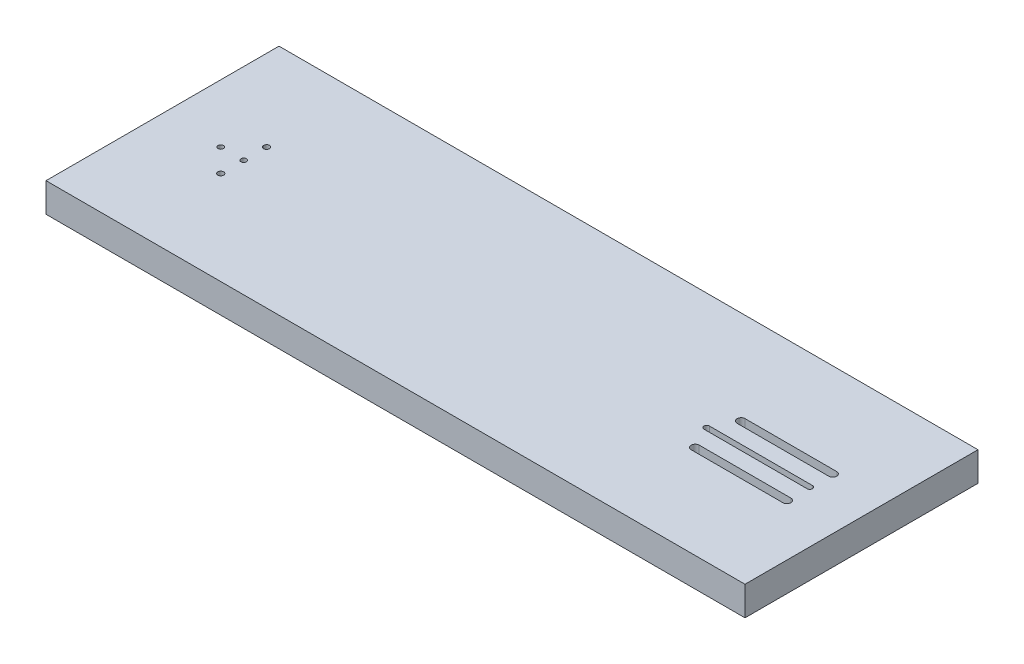
ISO-10303-21;
HEADER;
FILE_DESCRIPTION(('STEP AP214'),'2;1');
FILE_NAME('part.step','',(''),(''),'','','');
FILE_SCHEMA(('AUTOMOTIVE_DESIGN { 1 0 10303 214 1 1 1 1 }'));
ENDSEC;
DATA;
#1=APPLICATION_CONTEXT('core data for automotive mechanical design processes');
#2=APPLICATION_PROTOCOL_DEFINITION('international standard','automotive_design',2000,#1);
#3=PRODUCT_CONTEXT('',#1,'mechanical');
#4=PRODUCT('Part','Part','',(#3));
#5=PRODUCT_RELATED_PRODUCT_CATEGORY('part','',(#4));
#6=PRODUCT_DEFINITION_FORMATION('','',#4);
#7=PRODUCT_DEFINITION_CONTEXT('part definition',#1,'design');
#8=PRODUCT_DEFINITION('design','',#6,#7);
#9=PRODUCT_DEFINITION_SHAPE('','',#8);
#10=(LENGTH_UNIT() NAMED_UNIT(*) SI_UNIT(.MILLI.,.METRE.));
#11=(NAMED_UNIT(*) PLANE_ANGLE_UNIT() SI_UNIT($,.RADIAN.));
#12=(NAMED_UNIT(*) SI_UNIT($,.STERADIAN.) SOLID_ANGLE_UNIT());
#13=UNCERTAINTY_MEASURE_WITH_UNIT(LENGTH_MEASURE(1.E-05),#10,'distance_accuracy_value','');
#14=(GEOMETRIC_REPRESENTATION_CONTEXT(3) GLOBAL_UNCERTAINTY_ASSIGNED_CONTEXT((#13)) GLOBAL_UNIT_ASSIGNED_CONTEXT((#10,
#11,#12)) REPRESENTATION_CONTEXT('',''));
#15=CARTESIAN_POINT('',(0.,0.,0.));
#16=DIRECTION('',(0.,0.,1.));
#17=DIRECTION('',(1.,0.,0.));
#18=AXIS2_PLACEMENT_3D('',#15,#16,#17);
#19=CARTESIAN_POINT('',(484.541340044569,0.,-121.6));
#20=DIRECTION('',(0.,1.,0.));
#21=DIRECTION('',(0.,0.,1.));
#22=AXIS2_PLACEMENT_3D('',#19,#20,#21);
#23=CYLINDRICAL_SURFACE('',#22,3.49999999999999);
#24=CARTESIAN_POINT('',(484.541340044569,8.,-121.6));
#25=DIRECTION('',(0.,-1.,0.));
#26=DIRECTION('',(0.,0.,-1.));
#27=AXIS2_PLACEMENT_3D('',#24,#25,#26);
#28=CIRCLE('',#27,3.49999999999999);
#29=CARTESIAN_POINT('',(484.541340044569,8.,-125.1));
#30=VERTEX_POINT('',#29);
#31=CARTESIAN_POINT('',(484.541340044569,8.,-118.1));
#32=VERTEX_POINT('',#31);
#33=EDGE_CURVE('E57',#30,#32,#28,.F.);
#34=ORIENTED_EDGE('',*,*,#33,.F.);
#35=DIRECTION('',(0.,1.,0.));
#36=VECTOR('',#35,1.);
#37=CARTESIAN_POINT('',(484.541340044569,0.,-125.1));
#38=LINE('',#37,#36);
#39=CARTESIAN_POINT('',(484.541340044569,25.4,-125.1));
#40=VERTEX_POINT('',#39);
#41=EDGE_CURVE('E309',#30,#40,#38,.T.);
#42=ORIENTED_EDGE('',*,*,#41,.T.);
#43=CARTESIAN_POINT('',(484.541340044569,25.4,-121.6));
#44=DIRECTION('',(0.,1.,0.));
#45=DIRECTION('',(0.,0.,1.));
#46=AXIS2_PLACEMENT_3D('',#43,#44,#45);
#47=CIRCLE('',#46,3.49999999999999);
#48=CARTESIAN_POINT('',(484.541340044569,25.4,-118.1));
#49=VERTEX_POINT('',#48);
#50=EDGE_CURVE('E291',#40,#49,#47,.T.);
#51=ORIENTED_EDGE('',*,*,#50,.T.);
#52=DIRECTION('',(0.,1.,0.));
#53=VECTOR('',#52,1.);
#54=CARTESIAN_POINT('',(484.541340044569,0.,-118.1));
#55=LINE('',#54,#53);
#56=EDGE_CURVE('E308',#32,#49,#55,.T.);
#57=ORIENTED_EDGE('',*,*,#56,.F.);
#58=EDGE_LOOP('',(#34,#42,#51,#57));
#59=FACE_BOUND('',#58,.T.);
#60=ADVANCED_FACE('F35',(#59),#23,.F.);
#61=CARTESIAN_POINT('',(484.541340044569,0.,-125.1));
#62=DIRECTION('',(0.,0.,-1.));
#63=DIRECTION('',(-1.,0.,0.));
#64=AXIS2_PLACEMENT_3D('',#61,#62,#63);
#65=PLANE('',#64);
#66=DIRECTION('',(-1.,0.,0.));
#67=VECTOR('',#66,1.);
#68=CARTESIAN_POINT('',(484.541340044569,8.,-125.1));
#69=LINE('',#68,#67);
#70=CARTESIAN_POINT('',(564.541340044569,8.,-125.1));
#71=VERTEX_POINT('',#70);
#72=EDGE_CURVE('E235',#71,#30,#69,.T.);
#73=ORIENTED_EDGE('',*,*,#72,.F.);
#74=DIRECTION('',(0.,1.,0.));
#75=VECTOR('',#74,1.);
#76=CARTESIAN_POINT('',(564.541340044569,0.,-125.1));
#77=LINE('',#76,#75);
#78=CARTESIAN_POINT('',(564.541340044569,25.4,-125.1));
#79=VERTEX_POINT('',#78);
#80=EDGE_CURVE('E312',#71,#79,#77,.T.);
#81=ORIENTED_EDGE('',*,*,#80,.T.);
#82=DIRECTION('',(-1.,0.,0.));
#83=VECTOR('',#82,1.);
#84=CARTESIAN_POINT('',(484.541340044569,25.4,-125.1));
#85=LINE('',#84,#83);
#86=EDGE_CURVE('E305',#79,#40,#85,.T.);
#87=ORIENTED_EDGE('',*,*,#86,.T.);
#88=ORIENTED_EDGE('',*,*,#41,.F.);
#89=EDGE_LOOP('',(#73,#81,#87,#88));
#90=FACE_BOUND('',#89,.T.);
#91=ADVANCED_FACE('F440',(#90),#65,.F.);
#92=CARTESIAN_POINT('',(564.541340044569,0.,-121.6));
#93=DIRECTION('',(0.,1.,0.));
#94=DIRECTION('',(0.,0.,1.));
#95=AXIS2_PLACEMENT_3D('',#92,#93,#94);
#96=CYLINDRICAL_SURFACE('',#95,3.49999999999999);
#97=CARTESIAN_POINT('',(564.541340044569,8.,-121.6));
#98=DIRECTION('',(0.,-1.,0.));
#99=DIRECTION('',(0.,0.,-1.));
#100=AXIS2_PLACEMENT_3D('',#97,#98,#99);
#101=CIRCLE('',#100,3.49999999999999);
#102=CARTESIAN_POINT('',(564.541340044569,8.,-118.1));
#103=VERTEX_POINT('',#102);
#104=EDGE_CURVE('E230',#103,#71,#101,.F.);
#105=ORIENTED_EDGE('',*,*,#104,.F.);
#106=DIRECTION('',(0.,1.,0.));
#107=VECTOR('',#106,1.);
#108=CARTESIAN_POINT('',(564.541340044569,0.,-118.1));
#109=LINE('',#108,#107);
#110=CARTESIAN_POINT('',(564.541340044569,25.4,-118.1));
#111=VERTEX_POINT('',#110);
#112=EDGE_CURVE('E314',#103,#111,#109,.T.);
#113=ORIENTED_EDGE('',*,*,#112,.T.);
#114=CARTESIAN_POINT('',(564.541340044569,25.4,-121.6));
#115=DIRECTION('',(0.,1.,0.));
#116=DIRECTION('',(0.,0.,1.));
#117=AXIS2_PLACEMENT_3D('',#114,#115,#116);
#118=CIRCLE('',#117,3.49999999999999);
#119=EDGE_CURVE('E302',#111,#79,#118,.T.);
#120=ORIENTED_EDGE('',*,*,#119,.T.);
#121=ORIENTED_EDGE('',*,*,#80,.F.);
#122=EDGE_LOOP('',(#105,#113,#120,#121));
#123=FACE_BOUND('',#122,.T.);
#124=ADVANCED_FACE('F434',(#123),#96,.F.);
#125=CARTESIAN_POINT('',(484.541340044569,0.,-118.1));
#126=DIRECTION('',(0.,0.,1.));
#127=DIRECTION('',(1.,0.,0.));
#128=AXIS2_PLACEMENT_3D('',#125,#126,#127);
#129=PLANE('',#128);
#130=DIRECTION('',(1.,0.,0.));
#131=VECTOR('',#130,1.);
#132=CARTESIAN_POINT('',(484.541340044569,8.,-118.1));
#133=LINE('',#132,#131);
#134=EDGE_CURVE('E11',#32,#103,#133,.T.);
#135=ORIENTED_EDGE('',*,*,#134,.F.);
#136=ORIENTED_EDGE('',*,*,#56,.T.);
#137=DIRECTION('',(1.,0.,0.));
#138=VECTOR('',#137,1.);
#139=CARTESIAN_POINT('',(484.541340044569,25.4,-118.1));
#140=LINE('',#139,#138);
#141=EDGE_CURVE('E299',#49,#111,#140,.T.);
#142=ORIENTED_EDGE('',*,*,#141,.T.);
#143=ORIENTED_EDGE('',*,*,#112,.F.);
#144=EDGE_LOOP('',(#135,#136,#142,#143));
#145=FACE_BOUND('',#144,.T.);
#146=ADVANCED_FACE('F427',(#145),#129,.F.);
#147=CARTESIAN_POINT('',(484.541340044569,0.,-81.6));
#148=DIRECTION('',(0.,1.,0.));
#149=DIRECTION('',(0.,0.,1.));
#150=AXIS2_PLACEMENT_3D('',#147,#148,#149);
#151=CYLINDRICAL_SURFACE('',#150,3.5);
#152=CARTESIAN_POINT('',(484.541340044569,8.,-81.6));
#153=DIRECTION('',(0.,-1.,0.));
#154=DIRECTION('',(0.,0.,-1.));
#155=AXIS2_PLACEMENT_3D('',#152,#153,#154);
#156=CIRCLE('',#155,3.5);
#157=CARTESIAN_POINT('',(484.541340044569,8.,-85.1));
#158=VERTEX_POINT('',#157);
#159=CARTESIAN_POINT('',(484.541340044569,8.,-78.1));
#160=VERTEX_POINT('',#159);
#161=EDGE_CURVE('E274',#158,#160,#156,.F.);
#162=ORIENTED_EDGE('',*,*,#161,.F.);
#163=DIRECTION('',(0.,1.,0.));
#164=VECTOR('',#163,1.);
#165=CARTESIAN_POINT('',(484.541340044569,0.,-85.1));
#166=LINE('',#165,#164);
#167=CARTESIAN_POINT('',(484.541340044569,25.4,-85.1));
#168=VERTEX_POINT('',#167);
#169=EDGE_CURVE('E289',#158,#168,#166,.T.);
#170=ORIENTED_EDGE('',*,*,#169,.T.);
#171=CARTESIAN_POINT('',(484.541340044569,25.4,-81.6));
#172=DIRECTION('',(0.,1.,0.));
#173=DIRECTION('',(0.,0.,1.));
#174=AXIS2_PLACEMENT_3D('',#171,#172,#173);
#175=CIRCLE('',#174,3.5);
#176=CARTESIAN_POINT('',(484.541340044569,25.4,-78.1));
#177=VERTEX_POINT('',#176);
#178=EDGE_CURVE('E276',#168,#177,#175,.T.);
#179=ORIENTED_EDGE('',*,*,#178,.T.);
#180=DIRECTION('',(0.,1.,0.));
#181=VECTOR('',#180,1.);
#182=CARTESIAN_POINT('',(484.541340044569,0.,-78.1));
#183=LINE('',#182,#181);
#184=EDGE_CURVE('E288',#160,#177,#183,.T.);
#185=ORIENTED_EDGE('',*,*,#184,.F.);
#186=EDGE_LOOP('',(#162,#170,#179,#185));
#187=FACE_BOUND('',#186,.T.);
#188=ADVANCED_FACE('F425',(#187),#151,.F.);
#189=CARTESIAN_POINT('',(484.541340044569,0.,-85.1));
#190=DIRECTION('',(0.,0.,-1.));
#191=DIRECTION('',(-1.,0.,0.));
#192=AXIS2_PLACEMENT_3D('',#189,#190,#191);
#193=PLANE('',#192);
#194=DIRECTION('',(-1.,0.,0.));
#195=VECTOR('',#194,1.);
#196=CARTESIAN_POINT('',(484.541340044569,8.,-85.1));
#197=LINE('',#196,#195);
#198=CARTESIAN_POINT('',(564.541340044569,8.,-85.1));
#199=VERTEX_POINT('',#198);
#200=EDGE_CURVE('E272',#199,#158,#197,.T.);
#201=ORIENTED_EDGE('',*,*,#200,.F.);
#202=DIRECTION('',(0.,1.,0.));
#203=VECTOR('',#202,1.);
#204=CARTESIAN_POINT('',(564.541340044569,0.,-85.1));
#205=LINE('',#204,#203);
#206=CARTESIAN_POINT('',(564.541340044569,25.4,-85.1));
#207=VERTEX_POINT('',#206);
#208=EDGE_CURVE('E292',#199,#207,#205,.T.);
#209=ORIENTED_EDGE('',*,*,#208,.T.);
#210=DIRECTION('',(-1.,0.,0.));
#211=VECTOR('',#210,1.);
#212=CARTESIAN_POINT('',(484.541340044569,25.4,-85.1));
#213=LINE('',#212,#211);
#214=EDGE_CURVE('E285',#207,#168,#213,.T.);
#215=ORIENTED_EDGE('',*,*,#214,.T.);
#216=ORIENTED_EDGE('',*,*,#169,.F.);
#217=EDGE_LOOP('',(#201,#209,#215,#216));
#218=FACE_BOUND('',#217,.T.);
#219=ADVANCED_FACE('F423',(#218),#193,.F.);
#220=CARTESIAN_POINT('',(564.541340044569,0.,-81.6));
#221=DIRECTION('',(0.,1.,0.));
#222=DIRECTION('',(0.,0.,1.));
#223=AXIS2_PLACEMENT_3D('',#220,#221,#222);
#224=CYLINDRICAL_SURFACE('',#223,3.5);
#225=CARTESIAN_POINT('',(564.541340044569,8.,-81.6));
#226=DIRECTION('',(0.,-1.,0.));
#227=DIRECTION('',(0.,0.,-1.));
#228=AXIS2_PLACEMENT_3D('',#225,#226,#227);
#229=CIRCLE('',#228,3.5);
#230=CARTESIAN_POINT('',(564.541340044569,8.,-78.1));
#231=VERTEX_POINT('',#230);
#232=EDGE_CURVE('E264',#231,#199,#229,.F.);
#233=ORIENTED_EDGE('',*,*,#232,.F.);
#234=DIRECTION('',(0.,1.,0.));
#235=VECTOR('',#234,1.);
#236=CARTESIAN_POINT('',(564.541340044569,0.,-78.1));
#237=LINE('',#236,#235);
#238=CARTESIAN_POINT('',(564.541340044569,25.4,-78.1));
#239=VERTEX_POINT('',#238);
#240=EDGE_CURVE('E294',#231,#239,#237,.T.);
#241=ORIENTED_EDGE('',*,*,#240,.T.);
#242=CARTESIAN_POINT('',(564.541340044569,25.4,-81.6));
#243=DIRECTION('',(0.,1.,0.));
#244=DIRECTION('',(0.,0.,1.));
#245=AXIS2_PLACEMENT_3D('',#242,#243,#244);
#246=CIRCLE('',#245,3.5);
#247=EDGE_CURVE('E282',#239,#207,#246,.T.);
#248=ORIENTED_EDGE('',*,*,#247,.T.);
#249=ORIENTED_EDGE('',*,*,#208,.F.);
#250=EDGE_LOOP('',(#233,#241,#248,#249));
#251=FACE_BOUND('',#250,.T.);
#252=ADVANCED_FACE('F412',(#251),#224,.F.);
#253=CARTESIAN_POINT('',(484.541340044569,0.,-78.1));
#254=DIRECTION('',(0.,0.,1.));
#255=DIRECTION('',(1.,0.,0.));
#256=AXIS2_PLACEMENT_3D('',#253,#254,#255);
#257=PLANE('',#256);
#258=DIRECTION('',(1.,0.,0.));
#259=VECTOR('',#258,1.);
#260=CARTESIAN_POINT('',(484.541340044569,8.,-78.1));
#261=LINE('',#260,#259);
#262=EDGE_CURVE('E43',#160,#231,#261,.T.);
#263=ORIENTED_EDGE('',*,*,#262,.F.);
#264=ORIENTED_EDGE('',*,*,#184,.T.);
#265=DIRECTION('',(1.,0.,0.));
#266=VECTOR('',#265,1.);
#267=CARTESIAN_POINT('',(484.541340044569,25.4,-78.1));
#268=LINE('',#267,#266);
#269=EDGE_CURVE('E279',#177,#239,#268,.T.);
#270=ORIENTED_EDGE('',*,*,#269,.T.);
#271=ORIENTED_EDGE('',*,*,#240,.F.);
#272=EDGE_LOOP('',(#263,#264,#270,#271));
#273=FACE_BOUND('',#272,.T.);
#274=ADVANCED_FACE('F413',(#273),#257,.F.);
#275=CARTESIAN_POINT('',(0.,25.4,0.));
#276=DIRECTION('',(1.,0.,0.));
#277=DIRECTION('',(0.,0.,-1.));
#278=AXIS2_PLACEMENT_3D('',#275,#276,#277);
#279=PLANE('',#278);
#280=DIRECTION('',(0.,0.,1.));
#281=VECTOR('',#280,1.);
#282=CARTESIAN_POINT('',(0.,0.,0.));
#283=LINE('',#282,#281);
#284=CARTESIAN_POINT('',(0.,0.,-203.2));
#285=VERTEX_POINT('',#284);
#286=CARTESIAN_POINT('',(0.,0.,0.));
#287=VERTEX_POINT('',#286);
#288=EDGE_CURVE('E370',#285,#287,#283,.T.);
#289=ORIENTED_EDGE('',*,*,#288,.T.);
#290=DIRECTION('',(0.,-1.,0.));
#291=VECTOR('',#290,1.);
#292=CARTESIAN_POINT('',(0.,25.4,0.));
#293=LINE('',#292,#291);
#294=CARTESIAN_POINT('',(0.,25.4,0.));
#295=VERTEX_POINT('',#294);
#296=EDGE_CURVE('E399',#295,#287,#293,.T.);
#297=ORIENTED_EDGE('',*,*,#296,.F.);
#298=DIRECTION('',(0.,0.,1.));
#299=VECTOR('',#298,1.);
#300=CARTESIAN_POINT('',(0.,25.4,0.));
#301=LINE('',#300,#299);
#302=CARTESIAN_POINT('',(0.,25.4,-203.2));
#303=VERTEX_POINT('',#302);
#304=EDGE_CURVE('E373',#303,#295,#301,.T.);
#305=ORIENTED_EDGE('',*,*,#304,.F.);
#306=DIRECTION('',(0.,-1.,0.));
#307=VECTOR('',#306,1.);
#308=CARTESIAN_POINT('',(0.,25.4,-203.2));
#309=LINE('',#308,#307);
#310=EDGE_CURVE('E383',#303,#285,#309,.T.);
#311=ORIENTED_EDGE('',*,*,#310,.T.);
#312=EDGE_LOOP('',(#289,#297,#305,#311));
#313=FACE_BOUND('',#312,.T.);
#314=ADVANCED_FACE('F37',(#313),#279,.F.);
#315=CARTESIAN_POINT('',(0.,25.4,0.));
#316=DIRECTION('',(0.,0.,-1.));
#317=DIRECTION('',(-1.,0.,0.));
#318=AXIS2_PLACEMENT_3D('',#315,#316,#317);
#319=PLANE('',#318);
#320=DIRECTION('',(1.,0.,0.));
#321=VECTOR('',#320,1.);
#322=CARTESIAN_POINT('',(0.,0.,0.));
#323=LINE('',#322,#321);
#324=CARTESIAN_POINT('',(609.6,0.,0.));
#325=VERTEX_POINT('',#324);
#326=EDGE_CURVE('E386',#287,#325,#323,.T.);
#327=ORIENTED_EDGE('',*,*,#326,.T.);
#328=DIRECTION('',(0.,-1.,0.));
#329=VECTOR('',#328,1.);
#330=CARTESIAN_POINT('',(609.6,25.4,0.));
#331=LINE('',#330,#329);
#332=CARTESIAN_POINT('',(609.6,25.4,0.));
#333=VERTEX_POINT('',#332);
#334=EDGE_CURVE('E396',#333,#325,#331,.T.);
#335=ORIENTED_EDGE('',*,*,#334,.F.);
#336=DIRECTION('',(1.,0.,0.));
#337=VECTOR('',#336,1.);
#338=CARTESIAN_POINT('',(0.,25.4,0.));
#339=LINE('',#338,#337);
#340=EDGE_CURVE('E376',#295,#333,#339,.T.);
#341=ORIENTED_EDGE('',*,*,#340,.F.);
#342=ORIENTED_EDGE('',*,*,#296,.T.);
#343=EDGE_LOOP('',(#327,#335,#341,#342));
#344=FACE_BOUND('',#343,.T.);
#345=ADVANCED_FACE('F493',(#344),#319,.F.);
#346=CARTESIAN_POINT('',(609.6,25.4,0.));
#347=DIRECTION('',(-1.,0.,0.));
#348=DIRECTION('',(0.,0.,1.));
#349=AXIS2_PLACEMENT_3D('',#346,#347,#348);
#350=PLANE('',#349);
#351=DIRECTION('',(0.,0.,-1.));
#352=VECTOR('',#351,1.);
#353=CARTESIAN_POINT('',(609.6,0.,0.));
#354=LINE('',#353,#352);
#355=CARTESIAN_POINT('',(609.6,0.,-203.2));
#356=VERTEX_POINT('',#355);
#357=EDGE_CURVE('E388',#325,#356,#354,.T.);
#358=ORIENTED_EDGE('',*,*,#357,.T.);
#359=DIRECTION('',(0.,-1.,0.));
#360=VECTOR('',#359,1.);
#361=CARTESIAN_POINT('',(609.6,25.4,-203.2));
#362=LINE('',#361,#360);
#363=CARTESIAN_POINT('',(609.6,25.4,-203.2));
#364=VERTEX_POINT('',#363);
#365=EDGE_CURVE('E393',#364,#356,#362,.T.);
#366=ORIENTED_EDGE('',*,*,#365,.F.);
#367=DIRECTION('',(0.,0.,-1.));
#368=VECTOR('',#367,1.);
#369=CARTESIAN_POINT('',(609.6,25.4,0.));
#370=LINE('',#369,#368);
#371=EDGE_CURVE('E379',#333,#364,#370,.T.);
#372=ORIENTED_EDGE('',*,*,#371,.F.);
#373=ORIENTED_EDGE('',*,*,#334,.T.);
#374=EDGE_LOOP('',(#358,#366,#372,#373));
#375=FACE_BOUND('',#374,.T.);
#376=ADVANCED_FACE('F490',(#375),#350,.F.);
#377=CARTESIAN_POINT('',(0.,25.4,-203.2));
#378=DIRECTION('',(0.,0.,1.));
#379=DIRECTION('',(1.,0.,0.));
#380=AXIS2_PLACEMENT_3D('',#377,#378,#379);
#381=PLANE('',#380);
#382=DIRECTION('',(-1.,0.,0.));
#383=VECTOR('',#382,1.);
#384=CARTESIAN_POINT('',(0.,0.,-203.2));
#385=LINE('',#384,#383);
#386=EDGE_CURVE('E377',#356,#285,#385,.T.);
#387=ORIENTED_EDGE('',*,*,#386,.T.);
#388=ORIENTED_EDGE('',*,*,#310,.F.);
#389=DIRECTION('',(-1.,0.,0.));
#390=VECTOR('',#389,1.);
#391=CARTESIAN_POINT('',(0.,25.4,-203.2));
#392=LINE('',#391,#390);
#393=EDGE_CURVE('E381',#364,#303,#392,.T.);
#394=ORIENTED_EDGE('',*,*,#393,.F.);
#395=ORIENTED_EDGE('',*,*,#365,.T.);
#396=EDGE_LOOP('',(#387,#388,#394,#395));
#397=FACE_BOUND('',#396,.T.);
#398=ADVANCED_FACE('F484',(#397),#381,.F.);
#399=CARTESIAN_POINT('',(0.,25.4,0.));
#400=DIRECTION('',(0.,-1.,0.));
#401=DIRECTION('',(0.,0.,-1.));
#402=AXIS2_PLACEMENT_3D('',#399,#400,#401);
#403=PLANE('',#402);
#404=ORIENTED_EDGE('',*,*,#269,.F.);
#405=ORIENTED_EDGE('',*,*,#178,.F.);
#406=ORIENTED_EDGE('',*,*,#214,.F.);
#407=ORIENTED_EDGE('',*,*,#247,.F.);
#408=EDGE_LOOP('',(#404,#405,#406,#407));
#409=FACE_BOUND('',#408,.T.);
#410=ORIENTED_EDGE('',*,*,#141,.F.);
#411=ORIENTED_EDGE('',*,*,#50,.F.);
#412=ORIENTED_EDGE('',*,*,#86,.F.);
#413=ORIENTED_EDGE('',*,*,#119,.F.);
#414=EDGE_LOOP('',(#410,#411,#412,#413));
#415=FACE_BOUND('',#414,.T.);
#416=DIRECTION('',(1.,0.,0.));
#417=VECTOR('',#416,1.);
#418=CARTESIAN_POINT('',(474.530890234494,25.4,-99.2185));
#419=LINE('',#418,#417);
#420=CARTESIAN_POINT('',(474.530890234494,25.4,-99.2185));
#421=VERTEX_POINT('',#420);
#422=CARTESIAN_POINT('',(564.530890234494,25.4,-99.2185));
#423=VERTEX_POINT('',#422);
#424=EDGE_CURVE('E332',#421,#423,#419,.T.);
#425=ORIENTED_EDGE('',*,*,#424,.F.);
#426=CARTESIAN_POINT('',(474.530890234494,25.4,-101.6));
#427=DIRECTION('',(0.,1.,0.));
#428=DIRECTION('',(0.,0.,1.));
#429=AXIS2_PLACEMENT_3D('',#426,#427,#428);
#430=CIRCLE('',#429,2.38149999999999);
#431=CARTESIAN_POINT('',(474.530890234494,25.4,-103.9815));
#432=VERTEX_POINT('',#431);
#433=EDGE_CURVE('E311',#432,#421,#430,.T.);
#434=ORIENTED_EDGE('',*,*,#433,.F.);
#435=DIRECTION('',(-1.,0.,0.));
#436=VECTOR('',#435,1.);
#437=CARTESIAN_POINT('',(474.530890234494,25.4,-103.9815));
#438=LINE('',#437,#436);
#439=CARTESIAN_POINT('',(564.530890234494,25.4,-103.9815));
#440=VERTEX_POINT('',#439);
#441=EDGE_CURVE('E321',#440,#432,#438,.T.);
#442=ORIENTED_EDGE('',*,*,#441,.F.);
#443=CARTESIAN_POINT('',(564.530890234494,25.4,-101.6));
#444=DIRECTION('',(0.,1.,0.));
#445=DIRECTION('',(0.,0.,1.));
#446=AXIS2_PLACEMENT_3D('',#443,#444,#445);
#447=CIRCLE('',#446,2.38149999999999);
#448=EDGE_CURVE('E335',#423,#440,#447,.T.);
#449=ORIENTED_EDGE('',*,*,#448,.F.);
#450=EDGE_LOOP('',(#425,#434,#442,#449));
#451=FACE_BOUND('',#450,.T.);
#452=CARTESIAN_POINT('',(70.8,25.4,-81.6));
#453=DIRECTION('',(0.,1.,0.));
#454=DIRECTION('',(0.,0.,1.));
#455=AXIS2_PLACEMENT_3D('',#452,#453,#454);
#456=CIRCLE('',#455,2.5525);
#457=CARTESIAN_POINT('',(70.8,25.4,-79.0475));
#458=VERTEX_POINT('',#457);
#459=EDGE_CURVE('E342',#458,#458,#456,.T.);
#460=ORIENTED_EDGE('',*,*,#459,.F.);
#461=EDGE_LOOP('',(#460));
#462=FACE_BOUND('',#461,.T.);
#463=CARTESIAN_POINT('',(70.8,25.4,-121.6));
#464=DIRECTION('',(0.,1.,0.));
#465=DIRECTION('',(0.,0.,1.));
#466=AXIS2_PLACEMENT_3D('',#463,#464,#465);
#467=CIRCLE('',#466,2.5525);
#468=CARTESIAN_POINT('',(70.8,25.4,-119.0475));
#469=VERTEX_POINT('',#468);
#470=EDGE_CURVE('E352',#469,#469,#467,.T.);
#471=ORIENTED_EDGE('',*,*,#470,.F.);
#472=EDGE_LOOP('',(#471));
#473=FACE_BOUND('',#472,.T.);
#474=CARTESIAN_POINT('',(50.8,25.4,-101.6));
#475=DIRECTION('',(0.,1.,0.));
#476=DIRECTION('',(0.,0.,1.));
#477=AXIS2_PLACEMENT_3D('',#474,#475,#476);
#478=CIRCLE('',#477,2.3815);
#479=CARTESIAN_POINT('',(50.8,25.4,-99.2185));
#480=VERTEX_POINT('',#479);
#481=EDGE_CURVE('E358',#480,#480,#478,.T.);
#482=ORIENTED_EDGE('',*,*,#481,.F.);
#483=EDGE_LOOP('',(#482));
#484=FACE_BOUND('',#483,.T.);
#485=CARTESIAN_POINT('',(70.8,25.4,-101.6));
#486=DIRECTION('',(0.,1.,0.));
#487=DIRECTION('',(0.,0.,1.));
#488=AXIS2_PLACEMENT_3D('',#485,#486,#487);
#489=CIRCLE('',#488,2.3815);
#490=CARTESIAN_POINT('',(70.8,25.4,-99.2185));
#491=VERTEX_POINT('',#490);
#492=EDGE_CURVE('E364',#491,#491,#489,.T.);
#493=ORIENTED_EDGE('',*,*,#492,.F.);
#494=EDGE_LOOP('',(#493));
#495=FACE_BOUND('',#494,.T.);
#496=ORIENTED_EDGE('',*,*,#304,.T.);
#497=ORIENTED_EDGE('',*,*,#340,.T.);
#498=ORIENTED_EDGE('',*,*,#371,.T.);
#499=ORIENTED_EDGE('',*,*,#393,.T.);
#500=EDGE_LOOP('',(#496,#497,#498,#499));
#501=FACE_BOUND('',#500,.T.);
#502=ADVANCED_FACE('F419',(#409,#415,#451,#462,#473,#484,#495,#501),#403,.F.);
#503=CARTESIAN_POINT('',(0.,0.,0.));
#504=DIRECTION('',(0.,-1.,0.));
#505=DIRECTION('',(0.,0.,-1.));
#506=AXIS2_PLACEMENT_3D('',#503,#504,#505);
#507=PLANE('',#506);
#508=CARTESIAN_POINT('',(484.541340044569,0.,-121.6));
#509=DIRECTION('',(0.,-1.,0.));
#510=DIRECTION('',(0.,0.,-1.));
#511=AXIS2_PLACEMENT_3D('',#508,#509,#510);
#512=CIRCLE('',#511,5.49999999999996);
#513=CARTESIAN_POINT('',(484.541340044569,0.,-116.1));
#514=VERTEX_POINT('',#513);
#515=CARTESIAN_POINT('',(484.541340044569,0.,-127.1));
#516=VERTEX_POINT('',#515);
#517=EDGE_CURVE('E50',#514,#516,#512,.T.);
#518=ORIENTED_EDGE('',*,*,#517,.F.);
#519=DIRECTION('',(-1.,0.,0.));
#520=VECTOR('',#519,1.);
#521=CARTESIAN_POINT('',(484.541340044569,0.,-116.1));
#522=LINE('',#521,#520);
#523=CARTESIAN_POINT('',(564.541340044569,0.,-116.1));
#524=VERTEX_POINT('',#523);
#525=EDGE_CURVE('E215',#524,#514,#522,.T.);
#526=ORIENTED_EDGE('',*,*,#525,.F.);
#527=CARTESIAN_POINT('',(564.541340044569,0.,-121.6));
#528=DIRECTION('',(0.,-1.,0.));
#529=DIRECTION('',(0.,0.,-1.));
#530=AXIS2_PLACEMENT_3D('',#527,#528,#529);
#531=CIRCLE('',#530,5.49999999999996);
#532=CARTESIAN_POINT('',(564.541340044569,0.,-127.1));
#533=VERTEX_POINT('',#532);
#534=EDGE_CURVE('E218',#533,#524,#531,.T.);
#535=ORIENTED_EDGE('',*,*,#534,.F.);
#536=DIRECTION('',(1.,0.,0.));
#537=VECTOR('',#536,1.);
#538=CARTESIAN_POINT('',(484.541340044569,0.,-127.1));
#539=LINE('',#538,#537);
#540=EDGE_CURVE('E224',#516,#533,#539,.T.);
#541=ORIENTED_EDGE('',*,*,#540,.F.);
#542=EDGE_LOOP('',(#518,#526,#535,#541));
#543=FACE_BOUND('',#542,.T.);
#544=CARTESIAN_POINT('',(484.541340044569,0.,-81.6));
#545=DIRECTION('',(0.,-1.,0.));
#546=DIRECTION('',(0.,0.,-1.));
#547=AXIS2_PLACEMENT_3D('',#544,#545,#546);
#548=CIRCLE('',#547,5.49999999999999);
#549=CARTESIAN_POINT('',(484.541340044569,0.,-76.1));
#550=VERTEX_POINT('',#549);
#551=CARTESIAN_POINT('',(484.541340044569,0.,-87.1));
#552=VERTEX_POINT('',#551);
#553=EDGE_CURVE('E238',#550,#552,#548,.T.);
#554=ORIENTED_EDGE('',*,*,#553,.F.);
#555=DIRECTION('',(-1.,0.,0.));
#556=VECTOR('',#555,1.);
#557=CARTESIAN_POINT('',(484.541340044569,0.,-76.1));
#558=LINE('',#557,#556);
#559=CARTESIAN_POINT('',(564.541340044569,0.,-76.1));
#560=VERTEX_POINT('',#559);
#561=EDGE_CURVE('E243',#560,#550,#558,.T.);
#562=ORIENTED_EDGE('',*,*,#561,.F.);
#563=CARTESIAN_POINT('',(564.541340044569,0.,-81.6));
#564=DIRECTION('',(0.,-1.,0.));
#565=DIRECTION('',(0.,0.,-1.));
#566=AXIS2_PLACEMENT_3D('',#563,#564,#565);
#567=CIRCLE('',#566,5.49999999999999);
#568=CARTESIAN_POINT('',(564.541340044569,0.,-87.1));
#569=VERTEX_POINT('',#568);
#570=EDGE_CURVE('E257',#569,#560,#567,.T.);
#571=ORIENTED_EDGE('',*,*,#570,.F.);
#572=DIRECTION('',(1.,0.,0.));
#573=VECTOR('',#572,1.);
#574=CARTESIAN_POINT('',(484.541340044569,0.,-87.1));
#575=LINE('',#574,#573);
#576=EDGE_CURVE('E254',#552,#569,#575,.T.);
#577=ORIENTED_EDGE('',*,*,#576,.F.);
#578=EDGE_LOOP('',(#554,#562,#571,#577));
#579=FACE_BOUND('',#578,.T.);
#580=CARTESIAN_POINT('',(474.530890234494,0.,-101.6));
#581=DIRECTION('',(0.,1.,0.));
#582=DIRECTION('',(0.,0.,1.));
#583=AXIS2_PLACEMENT_3D('',#580,#581,#582);
#584=CIRCLE('',#583,2.38149999999999);
#585=CARTESIAN_POINT('',(474.530890234494,0.,-103.9815));
#586=VERTEX_POINT('',#585);
#587=CARTESIAN_POINT('',(474.530890234494,0.,-99.2185));
#588=VERTEX_POINT('',#587);
#589=EDGE_CURVE('E317',#586,#588,#584,.T.);
#590=ORIENTED_EDGE('',*,*,#589,.T.);
#591=DIRECTION('',(1.,0.,0.));
#592=VECTOR('',#591,1.);
#593=CARTESIAN_POINT('',(474.530890234494,0.,-99.2185));
#594=LINE('',#593,#592);
#595=CARTESIAN_POINT('',(564.530890234494,0.,-99.2185));
#596=VERTEX_POINT('',#595);
#597=EDGE_CURVE('E320',#588,#596,#594,.T.);
#598=ORIENTED_EDGE('',*,*,#597,.T.);
#599=CARTESIAN_POINT('',(564.530890234494,0.,-101.6));
#600=DIRECTION('',(0.,1.,0.));
#601=DIRECTION('',(0.,0.,1.));
#602=AXIS2_PLACEMENT_3D('',#599,#600,#601);
#603=CIRCLE('',#602,2.38149999999999);
#604=CARTESIAN_POINT('',(564.530890234494,0.,-103.9815));
#605=VERTEX_POINT('',#604);
#606=EDGE_CURVE('E324',#596,#605,#603,.T.);
#607=ORIENTED_EDGE('',*,*,#606,.T.);
#608=DIRECTION('',(-1.,0.,0.));
#609=VECTOR('',#608,1.);
#610=CARTESIAN_POINT('',(474.530890234494,0.,-103.9815));
#611=LINE('',#610,#609);
#612=EDGE_CURVE('E327',#605,#586,#611,.T.);
#613=ORIENTED_EDGE('',*,*,#612,.T.);
#614=EDGE_LOOP('',(#590,#598,#607,#613));
#615=FACE_BOUND('',#614,.T.);
#616=CARTESIAN_POINT('',(70.8,0.,-81.6));
#617=DIRECTION('',(0.,1.,0.));
#618=DIRECTION('',(0.,0.,1.));
#619=AXIS2_PLACEMENT_3D('',#616,#617,#618);
#620=CIRCLE('',#619,2.5525);
#621=CARTESIAN_POINT('',(70.8,0.,-79.0475));
#622=VERTEX_POINT('',#621);
#623=EDGE_CURVE('E349',#622,#622,#620,.T.);
#624=ORIENTED_EDGE('',*,*,#623,.T.);
#625=EDGE_LOOP('',(#624));
#626=FACE_BOUND('',#625,.T.);
#627=CARTESIAN_POINT('',(70.8,0.,-121.6));
#628=DIRECTION('',(0.,1.,0.));
#629=DIRECTION('',(0.,0.,1.));
#630=AXIS2_PLACEMENT_3D('',#627,#628,#629);
#631=CIRCLE('',#630,2.5525);
#632=CARTESIAN_POINT('',(70.8,0.,-119.0475));
#633=VERTEX_POINT('',#632);
#634=EDGE_CURVE('E355',#633,#633,#631,.T.);
#635=ORIENTED_EDGE('',*,*,#634,.T.);
#636=EDGE_LOOP('',(#635));
#637=FACE_BOUND('',#636,.T.);
#638=CARTESIAN_POINT('',(50.8,0.,-101.6));
#639=DIRECTION('',(0.,1.,0.));
#640=DIRECTION('',(0.,0.,1.));
#641=AXIS2_PLACEMENT_3D('',#638,#639,#640);
#642=CIRCLE('',#641,2.3815);
#643=CARTESIAN_POINT('',(50.8,0.,-99.2185));
#644=VERTEX_POINT('',#643);
#645=EDGE_CURVE('E361',#644,#644,#642,.T.);
#646=ORIENTED_EDGE('',*,*,#645,.T.);
#647=EDGE_LOOP('',(#646));
#648=FACE_BOUND('',#647,.T.);
#649=CARTESIAN_POINT('',(70.8,0.,-101.6));
#650=DIRECTION('',(0.,1.,0.));
#651=DIRECTION('',(0.,0.,1.));
#652=AXIS2_PLACEMENT_3D('',#649,#650,#651);
#653=CIRCLE('',#652,2.3815);
#654=CARTESIAN_POINT('',(70.8,0.,-99.2185));
#655=VERTEX_POINT('',#654);
#656=EDGE_CURVE('E367',#655,#655,#653,.T.);
#657=ORIENTED_EDGE('',*,*,#656,.T.);
#658=EDGE_LOOP('',(#657));
#659=FACE_BOUND('',#658,.T.);
#660=ORIENTED_EDGE('',*,*,#288,.F.);
#661=ORIENTED_EDGE('',*,*,#386,.F.);
#662=ORIENTED_EDGE('',*,*,#357,.F.);
#663=ORIENTED_EDGE('',*,*,#326,.F.);
#664=EDGE_LOOP('',(#660,#661,#662,#663));
#665=FACE_BOUND('',#664,.T.);
#666=ADVANCED_FACE('F480',(#543,#579,#615,#626,#637,#648,#659,#665),#507,.T.);
#667=CARTESIAN_POINT('',(70.8,0.,-101.6));
#668=DIRECTION('',(0.,1.,0.));
#669=DIRECTION('',(0.,0.,1.));
#670=AXIS2_PLACEMENT_3D('',#667,#668,#669);
#671=CYLINDRICAL_SURFACE('',#670,2.3815);
#672=ORIENTED_EDGE('',*,*,#656,.F.);
#673=EDGE_LOOP('',(#672));
#674=FACE_BOUND('',#673,.T.);
#675=ORIENTED_EDGE('',*,*,#492,.T.);
#676=EDGE_LOOP('',(#675));
#677=FACE_BOUND('',#676,.T.);
#678=ADVANCED_FACE('F476',(#674,#677),#671,.F.);
#679=CARTESIAN_POINT('',(50.8,0.,-101.6));
#680=DIRECTION('',(0.,1.,0.));
#681=DIRECTION('',(0.,0.,1.));
#682=AXIS2_PLACEMENT_3D('',#679,#680,#681);
#683=CYLINDRICAL_SURFACE('',#682,2.3815);
#684=ORIENTED_EDGE('',*,*,#645,.F.);
#685=EDGE_LOOP('',(#684));
#686=FACE_BOUND('',#685,.T.);
#687=ORIENTED_EDGE('',*,*,#481,.T.);
#688=EDGE_LOOP('',(#687));
#689=FACE_BOUND('',#688,.T.);
#690=ADVANCED_FACE('F472',(#686,#689),#683,.F.);
#691=CARTESIAN_POINT('',(70.8,0.,-121.6));
#692=DIRECTION('',(0.,1.,0.));
#693=DIRECTION('',(0.,0.,1.));
#694=AXIS2_PLACEMENT_3D('',#691,#692,#693);
#695=CYLINDRICAL_SURFACE('',#694,2.5525);
#696=ORIENTED_EDGE('',*,*,#634,.F.);
#697=EDGE_LOOP('',(#696));
#698=FACE_BOUND('',#697,.T.);
#699=ORIENTED_EDGE('',*,*,#470,.T.);
#700=EDGE_LOOP('',(#699));
#701=FACE_BOUND('',#700,.T.);
#702=ADVANCED_FACE('F468',(#698,#701),#695,.F.);
#703=CARTESIAN_POINT('',(70.8,0.,-81.6));
#704=DIRECTION('',(0.,1.,0.));
#705=DIRECTION('',(0.,0.,1.));
#706=AXIS2_PLACEMENT_3D('',#703,#704,#705);
#707=CYLINDRICAL_SURFACE('',#706,2.5525);
#708=ORIENTED_EDGE('',*,*,#623,.F.);
#709=EDGE_LOOP('',(#708));
#710=FACE_BOUND('',#709,.T.);
#711=ORIENTED_EDGE('',*,*,#459,.T.);
#712=EDGE_LOOP('',(#711));
#713=FACE_BOUND('',#712,.T.);
#714=ADVANCED_FACE('F464',(#710,#713),#707,.F.);
#715=CARTESIAN_POINT('',(474.530890234494,0.,-101.6));
#716=DIRECTION('',(0.,1.,0.));
#717=DIRECTION('',(0.,0.,1.));
#718=AXIS2_PLACEMENT_3D('',#715,#716,#717);
#719=CYLINDRICAL_SURFACE('',#718,2.38149999999999);
#720=ORIENTED_EDGE('',*,*,#433,.T.);
#721=DIRECTION('',(0.,1.,0.));
#722=VECTOR('',#721,1.);
#723=CARTESIAN_POINT('',(474.530890234494,0.,-99.2185));
#724=LINE('',#723,#722);
#725=EDGE_CURVE('E330',#588,#421,#724,.T.);
#726=ORIENTED_EDGE('',*,*,#725,.F.);
#727=ORIENTED_EDGE('',*,*,#589,.F.);
#728=DIRECTION('',(0.,1.,0.));
#729=VECTOR('',#728,1.);
#730=CARTESIAN_POINT('',(474.530890234494,0.,-103.9815));
#731=LINE('',#730,#729);
#732=EDGE_CURVE('E340',#586,#432,#731,.T.);
#733=ORIENTED_EDGE('',*,*,#732,.T.);
#734=EDGE_LOOP('',(#720,#726,#727,#733));
#735=FACE_BOUND('',#734,.T.);
#736=ADVANCED_FACE('F453',(#735),#719,.F.);
#737=CARTESIAN_POINT('',(474.530890234494,0.,-103.9815));
#738=DIRECTION('',(0.,0.,-1.));
#739=DIRECTION('',(-1.,0.,0.));
#740=AXIS2_PLACEMENT_3D('',#737,#738,#739);
#741=PLANE('',#740);
#742=ORIENTED_EDGE('',*,*,#441,.T.);
#743=ORIENTED_EDGE('',*,*,#732,.F.);
#744=ORIENTED_EDGE('',*,*,#612,.F.);
#745=DIRECTION('',(0.,1.,0.));
#746=VECTOR('',#745,1.);
#747=CARTESIAN_POINT('',(564.530890234494,0.,-103.9815));
#748=LINE('',#747,#746);
#749=EDGE_CURVE('E343',#605,#440,#748,.T.);
#750=ORIENTED_EDGE('',*,*,#749,.T.);
#751=EDGE_LOOP('',(#742,#743,#744,#750));
#752=FACE_BOUND('',#751,.T.);
#753=ADVANCED_FACE('F449',(#752),#741,.F.);
#754=CARTESIAN_POINT('',(564.530890234494,0.,-101.6));
#755=DIRECTION('',(0.,1.,0.));
#756=DIRECTION('',(0.,0.,1.));
#757=AXIS2_PLACEMENT_3D('',#754,#755,#756);
#758=CYLINDRICAL_SURFACE('',#757,2.38149999999999);
#759=ORIENTED_EDGE('',*,*,#448,.T.);
#760=ORIENTED_EDGE('',*,*,#749,.F.);
#761=ORIENTED_EDGE('',*,*,#606,.F.);
#762=DIRECTION('',(0.,1.,0.));
#763=VECTOR('',#762,1.);
#764=CARTESIAN_POINT('',(564.530890234494,0.,-99.2185));
#765=LINE('',#764,#763);
#766=EDGE_CURVE('E345',#596,#423,#765,.T.);
#767=ORIENTED_EDGE('',*,*,#766,.T.);
#768=EDGE_LOOP('',(#759,#760,#761,#767));
#769=FACE_BOUND('',#768,.T.);
#770=ADVANCED_FACE('F452',(#769),#758,.F.);
#771=CARTESIAN_POINT('',(474.530890234494,0.,-99.2185));
#772=DIRECTION('',(0.,0.,1.));
#773=DIRECTION('',(1.,0.,0.));
#774=AXIS2_PLACEMENT_3D('',#771,#772,#773);
#775=PLANE('',#774);
#776=ORIENTED_EDGE('',*,*,#424,.T.);
#777=ORIENTED_EDGE('',*,*,#766,.F.);
#778=ORIENTED_EDGE('',*,*,#597,.F.);
#779=ORIENTED_EDGE('',*,*,#725,.T.);
#780=EDGE_LOOP('',(#776,#777,#778,#779));
#781=FACE_BOUND('',#780,.T.);
#782=ADVANCED_FACE('F457',(#781),#775,.F.);
#783=CARTESIAN_POINT('',(484.541340044569,8.,-81.6));
#784=DIRECTION('',(0.,-1.,0.));
#785=DIRECTION('',(0.,0.,-1.));
#786=AXIS2_PLACEMENT_3D('',#783,#784,#785);
#787=PLANE('',#786);
#788=CARTESIAN_POINT('',(484.541340044569,8.,-81.6));
#789=DIRECTION('',(0.,-1.,0.));
#790=DIRECTION('',(0.,0.,-1.));
#791=AXIS2_PLACEMENT_3D('',#788,#789,#790);
#792=CIRCLE('',#791,5.49999999999999);
#793=CARTESIAN_POINT('',(484.541340044569,8.,-76.1));
#794=VERTEX_POINT('',#793);
#795=CARTESIAN_POINT('',(484.541340044569,8.,-87.1));
#796=VERTEX_POINT('',#795);
#797=EDGE_CURVE('E239',#794,#796,#792,.T.);
#798=ORIENTED_EDGE('',*,*,#797,.T.);
#799=DIRECTION('',(1.,0.,0.));
#800=VECTOR('',#799,1.);
#801=CARTESIAN_POINT('',(484.541340044569,8.,-87.1));
#802=LINE('',#801,#800);
#803=CARTESIAN_POINT('',(564.541340044569,8.,-87.1));
#804=VERTEX_POINT('',#803);
#805=EDGE_CURVE('E242',#796,#804,#802,.T.);
#806=ORIENTED_EDGE('',*,*,#805,.T.);
#807=CARTESIAN_POINT('',(564.541340044569,8.,-81.6));
#808=DIRECTION('',(0.,-1.,0.));
#809=DIRECTION('',(0.,0.,-1.));
#810=AXIS2_PLACEMENT_3D('',#807,#808,#809);
#811=CIRCLE('',#810,5.49999999999999);
#812=CARTESIAN_POINT('',(564.541340044569,8.,-76.1));
#813=VERTEX_POINT('',#812);
#814=EDGE_CURVE('E246',#804,#813,#811,.T.);
#815=ORIENTED_EDGE('',*,*,#814,.T.);
#816=DIRECTION('',(-1.,0.,0.));
#817=VECTOR('',#816,1.);
#818=CARTESIAN_POINT('',(484.541340044569,8.,-76.1));
#819=LINE('',#818,#817);
#820=EDGE_CURVE('E249',#813,#794,#819,.T.);
#821=ORIENTED_EDGE('',*,*,#820,.T.);
#822=EDGE_LOOP('',(#798,#806,#815,#821));
#823=FACE_BOUND('',#822,.T.);
#824=ORIENTED_EDGE('',*,*,#161,.T.);
#825=ORIENTED_EDGE('',*,*,#262,.T.);
#826=ORIENTED_EDGE('',*,*,#232,.T.);
#827=ORIENTED_EDGE('',*,*,#200,.T.);
#828=EDGE_LOOP('',(#824,#825,#826,#827));
#829=FACE_BOUND('',#828,.T.);
#830=ADVANCED_FACE('F404',(#823,#829),#787,.T.);
#831=CARTESIAN_POINT('',(484.541340044569,8.,-81.6));
#832=DIRECTION('',(0.,-1.,0.));
#833=DIRECTION('',(0.,0.,-1.));
#834=AXIS2_PLACEMENT_3D('',#831,#832,#833);
#835=CYLINDRICAL_SURFACE('',#834,5.49999999999999);
#836=ORIENTED_EDGE('',*,*,#553,.T.);
#837=DIRECTION('',(0.,-1.,0.));
#838=VECTOR('',#837,1.);
#839=CARTESIAN_POINT('',(484.541340044569,8.,-87.1));
#840=LINE('',#839,#838);
#841=EDGE_CURVE('E252',#796,#552,#840,.T.);
#842=ORIENTED_EDGE('',*,*,#841,.F.);
#843=ORIENTED_EDGE('',*,*,#797,.F.);
#844=DIRECTION('',(0.,-1.,0.));
#845=VECTOR('',#844,1.);
#846=CARTESIAN_POINT('',(484.541340044569,8.,-76.1));
#847=LINE('',#846,#845);
#848=EDGE_CURVE('E262',#794,#550,#847,.T.);
#849=ORIENTED_EDGE('',*,*,#848,.T.);
#850=EDGE_LOOP('',(#836,#842,#843,#849));
#851=FACE_BOUND('',#850,.T.);
#852=ADVANCED_FACE('F521',(#851),#835,.F.);
#853=CARTESIAN_POINT('',(484.541340044569,8.,-76.1));
#854=DIRECTION('',(0.,0.,1.));
#855=DIRECTION('',(1.,0.,0.));
#856=AXIS2_PLACEMENT_3D('',#853,#854,#855);
#857=PLANE('',#856);
#858=ORIENTED_EDGE('',*,*,#561,.T.);
#859=ORIENTED_EDGE('',*,*,#848,.F.);
#860=ORIENTED_EDGE('',*,*,#820,.F.);
#861=DIRECTION('',(0.,-1.,0.));
#862=VECTOR('',#861,1.);
#863=CARTESIAN_POINT('',(564.541340044569,8.,-76.1));
#864=LINE('',#863,#862);
#865=EDGE_CURVE('E265',#813,#560,#864,.T.);
#866=ORIENTED_EDGE('',*,*,#865,.T.);
#867=EDGE_LOOP('',(#858,#859,#860,#866));
#868=FACE_BOUND('',#867,.T.);
#869=ADVANCED_FACE('F524',(#868),#857,.F.);
#870=CARTESIAN_POINT('',(564.541340044569,8.,-81.6));
#871=DIRECTION('',(0.,-1.,0.));
#872=DIRECTION('',(0.,0.,-1.));
#873=AXIS2_PLACEMENT_3D('',#870,#871,#872);
#874=CYLINDRICAL_SURFACE('',#873,5.49999999999999);
#875=ORIENTED_EDGE('',*,*,#570,.T.);
#876=ORIENTED_EDGE('',*,*,#865,.F.);
#877=ORIENTED_EDGE('',*,*,#814,.F.);
#878=DIRECTION('',(0.,-1.,0.));
#879=VECTOR('',#878,1.);
#880=CARTESIAN_POINT('',(564.541340044569,8.,-87.1));
#881=LINE('',#880,#879);
#882=EDGE_CURVE('E267',#804,#569,#881,.T.);
#883=ORIENTED_EDGE('',*,*,#882,.T.);
#884=EDGE_LOOP('',(#875,#876,#877,#883));
#885=FACE_BOUND('',#884,.T.);
#886=ADVANCED_FACE('F529',(#885),#874,.F.);
#887=CARTESIAN_POINT('',(484.541340044569,8.,-87.1));
#888=DIRECTION('',(0.,0.,-1.));
#889=DIRECTION('',(-1.,0.,0.));
#890=AXIS2_PLACEMENT_3D('',#887,#888,#889);
#891=PLANE('',#890);
#892=ORIENTED_EDGE('',*,*,#576,.T.);
#893=ORIENTED_EDGE('',*,*,#882,.F.);
#894=ORIENTED_EDGE('',*,*,#805,.F.);
#895=ORIENTED_EDGE('',*,*,#841,.T.);
#896=EDGE_LOOP('',(#892,#893,#894,#895));
#897=FACE_BOUND('',#896,.T.);
#898=ADVANCED_FACE('F526',(#897),#891,.F.);
#899=CARTESIAN_POINT('',(484.541340044569,8.,-121.6));
#900=DIRECTION('',(0.,-1.,0.));
#901=DIRECTION('',(0.,0.,-1.));
#902=AXIS2_PLACEMENT_3D('',#899,#900,#901);
#903=PLANE('',#902);
#904=CARTESIAN_POINT('',(484.541340044569,8.,-121.6));
#905=DIRECTION('',(0.,-1.,0.));
#906=DIRECTION('',(0.,0.,-1.));
#907=AXIS2_PLACEMENT_3D('',#904,#905,#906);
#908=CIRCLE('',#907,5.49999999999996);
#909=CARTESIAN_POINT('',(484.541340044569,8.,-116.1));
#910=VERTEX_POINT('',#909);
#911=CARTESIAN_POINT('',(484.541340044569,8.,-127.1));
#912=VERTEX_POINT('',#911);
#913=EDGE_CURVE('E197',#910,#912,#908,.T.);
#914=ORIENTED_EDGE('',*,*,#913,.T.);
#915=DIRECTION('',(1.,0.,0.));
#916=VECTOR('',#915,1.);
#917=CARTESIAN_POINT('',(484.541340044569,8.,-127.1));
#918=LINE('',#917,#916);
#919=CARTESIAN_POINT('',(564.541340044569,8.,-127.1));
#920=VERTEX_POINT('',#919);
#921=EDGE_CURVE('E206',#912,#920,#918,.T.);
#922=ORIENTED_EDGE('',*,*,#921,.T.);
#923=CARTESIAN_POINT('',(564.541340044569,8.,-121.6));
#924=DIRECTION('',(0.,-1.,0.));
#925=DIRECTION('',(0.,0.,-1.));
#926=AXIS2_PLACEMENT_3D('',#923,#924,#925);
#927=CIRCLE('',#926,5.49999999999996);
#928=CARTESIAN_POINT('',(564.541340044569,8.,-116.1));
#929=VERTEX_POINT('',#928);
#930=EDGE_CURVE('E211',#920,#929,#927,.T.);
#931=ORIENTED_EDGE('',*,*,#930,.T.);
#932=DIRECTION('',(-1.,0.,0.));
#933=VECTOR('',#932,1.);
#934=CARTESIAN_POINT('',(484.541340044569,8.,-116.1));
#935=LINE('',#934,#933);
#936=EDGE_CURVE('E203',#929,#910,#935,.T.);
#937=ORIENTED_EDGE('',*,*,#936,.T.);
#938=EDGE_LOOP('',(#914,#922,#931,#937));
#939=FACE_BOUND('',#938,.T.);
#940=ORIENTED_EDGE('',*,*,#33,.T.);
#941=ORIENTED_EDGE('',*,*,#134,.T.);
#942=ORIENTED_EDGE('',*,*,#104,.T.);
#943=ORIENTED_EDGE('',*,*,#72,.T.);
#944=EDGE_LOOP('',(#940,#941,#942,#943));
#945=FACE_BOUND('',#944,.T.);
#946=ADVANCED_FACE('F213',(#939,#945),#903,.T.);
#947=CARTESIAN_POINT('',(484.541340044569,8.,-121.6));
#948=DIRECTION('',(0.,-1.,0.));
#949=DIRECTION('',(0.,0.,-1.));
#950=AXIS2_PLACEMENT_3D('',#947,#948,#949);
#951=CYLINDRICAL_SURFACE('',#950,5.49999999999996);
#952=ORIENTED_EDGE('',*,*,#517,.T.);
#953=DIRECTION('',(0.,-1.,0.));
#954=VECTOR('',#953,1.);
#955=CARTESIAN_POINT('',(484.541340044569,8.,-127.1));
#956=LINE('',#955,#954);
#957=EDGE_CURVE('E193',#912,#516,#956,.T.);
#958=ORIENTED_EDGE('',*,*,#957,.F.);
#959=ORIENTED_EDGE('',*,*,#913,.F.);
#960=DIRECTION('',(0.,-1.,0.));
#961=VECTOR('',#960,1.);
#962=CARTESIAN_POINT('',(484.541340044569,8.,-116.1));
#963=LINE('',#962,#961);
#964=EDGE_CURVE('E228',#910,#514,#963,.T.);
#965=ORIENTED_EDGE('',*,*,#964,.T.);
#966=EDGE_LOOP('',(#952,#958,#959,#965));
#967=FACE_BOUND('',#966,.T.);
#968=ADVANCED_FACE('F195',(#967),#951,.F.);
#969=CARTESIAN_POINT('',(484.541340044569,8.,-116.1));
#970=DIRECTION('',(0.,0.,1.));
#971=DIRECTION('',(1.,0.,0.));
#972=AXIS2_PLACEMENT_3D('',#969,#970,#971);
#973=PLANE('',#972);
#974=ORIENTED_EDGE('',*,*,#525,.T.);
#975=ORIENTED_EDGE('',*,*,#964,.F.);
#976=ORIENTED_EDGE('',*,*,#936,.F.);
#977=DIRECTION('',(0.,-1.,0.));
#978=VECTOR('',#977,1.);
#979=CARTESIAN_POINT('',(564.541340044569,8.,-116.1));
#980=LINE('',#979,#978);
#981=EDGE_CURVE('E231',#929,#524,#980,.T.);
#982=ORIENTED_EDGE('',*,*,#981,.T.);
#983=EDGE_LOOP('',(#974,#975,#976,#982));
#984=FACE_BOUND('',#983,.T.);
#985=ADVANCED_FACE('F542',(#984),#973,.F.);
#986=CARTESIAN_POINT('',(564.541340044569,8.,-121.6));
#987=DIRECTION('',(0.,-1.,0.));
#988=DIRECTION('',(0.,0.,-1.));
#989=AXIS2_PLACEMENT_3D('',#986,#987,#988);
#990=CYLINDRICAL_SURFACE('',#989,5.49999999999996);
#991=ORIENTED_EDGE('',*,*,#534,.T.);
#992=ORIENTED_EDGE('',*,*,#981,.F.);
#993=ORIENTED_EDGE('',*,*,#930,.F.);
#994=DIRECTION('',(0.,-1.,0.));
#995=VECTOR('',#994,1.);
#996=CARTESIAN_POINT('',(564.541340044569,8.,-127.1));
#997=LINE('',#996,#995);
#998=EDGE_CURVE('E202',#920,#533,#997,.T.);
#999=ORIENTED_EDGE('',*,*,#998,.T.);
#1000=EDGE_LOOP('',(#991,#992,#993,#999));
#1001=FACE_BOUND('',#1000,.T.);
#1002=ADVANCED_FACE('F545',(#1001),#990,.F.);
#1003=CARTESIAN_POINT('',(484.541340044569,8.,-127.1));
#1004=DIRECTION('',(0.,0.,-1.));
#1005=DIRECTION('',(-1.,0.,0.));
#1006=AXIS2_PLACEMENT_3D('',#1003,#1004,#1005);
#1007=PLANE('',#1006);
#1008=ORIENTED_EDGE('',*,*,#540,.T.);
#1009=ORIENTED_EDGE('',*,*,#998,.F.);
#1010=ORIENTED_EDGE('',*,*,#921,.F.);
#1011=ORIENTED_EDGE('',*,*,#957,.T.);
#1012=EDGE_LOOP('',(#1008,#1009,#1010,#1011));
#1013=FACE_BOUND('',#1012,.T.);
#1014=ADVANCED_FACE('F207',(#1013),#1007,.F.);
#1015=CLOSED_SHELL('',(#60,#91,#124,#146,#188,#219,#252,#274,#314,#345,#376,#398,#502,#666,#678,
#690,#702,#714,#736,#753,#770,#782,#830,#852,#869,#886,#898,#946,#968,#985,#1002,#1014));
#1016=MANIFOLD_SOLID_BREP('B2',#1015);
#1017=ADVANCED_BREP_SHAPE_REPRESENTATION('',(#18,#1016),#14);
#1018=SHAPE_DEFINITION_REPRESENTATION(#9,#1017);
ENDSEC;
END-ISO-10303-21;
